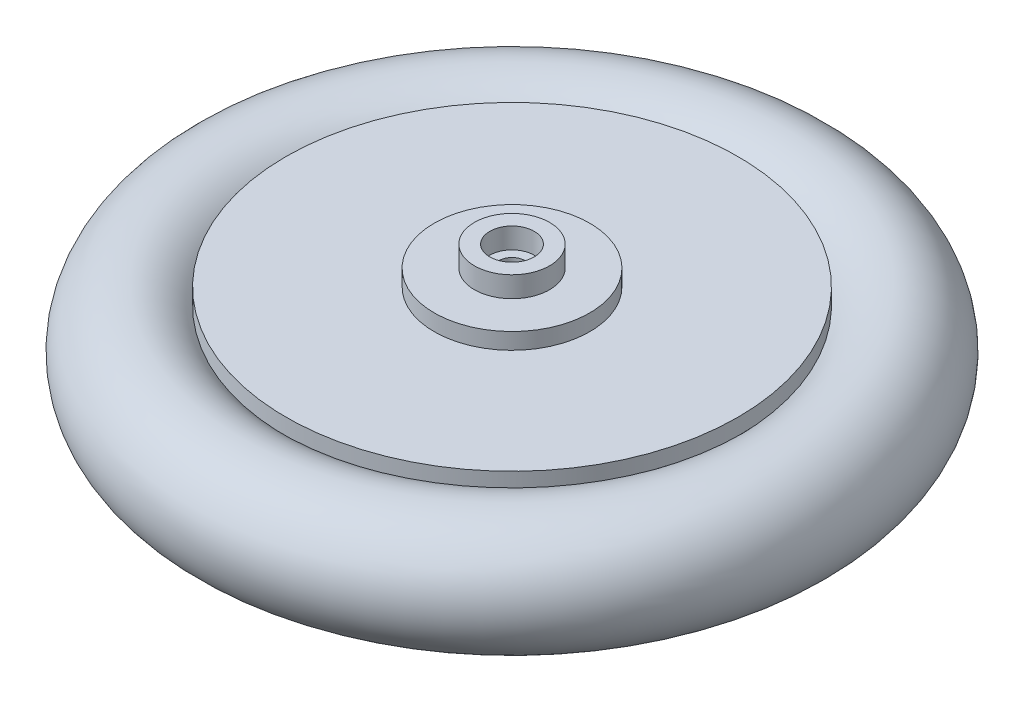
ISO-10303-21;
HEADER;
FILE_DESCRIPTION(('STEP AP214'),'2;1');
FILE_NAME('part.step','',(''),(''),'','','');
FILE_SCHEMA(('AUTOMOTIVE_DESIGN { 1 0 10303 214 1 1 1 1 }'));
ENDSEC;
DATA;
#1=APPLICATION_CONTEXT('core data for automotive mechanical design processes');
#2=APPLICATION_PROTOCOL_DEFINITION('international standard','automotive_design',2000,#1);
#3=PRODUCT_CONTEXT('',#1,'mechanical');
#4=PRODUCT('Part','Part','',(#3));
#5=PRODUCT_RELATED_PRODUCT_CATEGORY('part','',(#4));
#6=PRODUCT_DEFINITION_FORMATION('','',#4);
#7=PRODUCT_DEFINITION_CONTEXT('part definition',#1,'design');
#8=PRODUCT_DEFINITION('design','',#6,#7);
#9=PRODUCT_DEFINITION_SHAPE('','',#8);
#10=(LENGTH_UNIT() NAMED_UNIT(*) SI_UNIT(.MILLI.,.METRE.));
#11=(NAMED_UNIT(*) PLANE_ANGLE_UNIT() SI_UNIT($,.RADIAN.));
#12=(NAMED_UNIT(*) SI_UNIT($,.STERADIAN.) SOLID_ANGLE_UNIT());
#13=UNCERTAINTY_MEASURE_WITH_UNIT(LENGTH_MEASURE(1.E-05),#10,'distance_accuracy_value','');
#14=(GEOMETRIC_REPRESENTATION_CONTEXT(3) GLOBAL_UNCERTAINTY_ASSIGNED_CONTEXT((#13)) GLOBAL_UNIT_ASSIGNED_CONTEXT((#10,
#11,#12)) REPRESENTATION_CONTEXT('',''));
#15=CARTESIAN_POINT('',(0.,0.,0.));
#16=DIRECTION('',(0.,0.,1.));
#17=DIRECTION('',(1.,0.,0.));
#18=AXIS2_PLACEMENT_3D('',#15,#16,#17);
#19=CARTESIAN_POINT('',(-0.5,9.7,0.));
#20=DIRECTION('',(0.,1.,0.));
#21=DIRECTION('',(-1.,0.,0.));
#22=AXIS2_PLACEMENT_3D('',#19,#20,#21);
#23=CYLINDRICAL_SURFACE('',#22,30.5);
#24=CARTESIAN_POINT('',(-0.499999999999993,-5.2915026221292,0.));
#25=DIRECTION('',(0.,1.,0.));
#26=DIRECTION('',(-1.,0.,0.));
#27=AXIS2_PLACEMENT_3D('',#24,#25,#26);
#28=CIRCLE('',#27,30.5);
#29=CARTESIAN_POINT('',(-31.,-5.29150262212921,0.));
#30=VERTEX_POINT('',#29);
#31=EDGE_CURVE('E10',#30,#30,#28,.T.);
#32=ORIENTED_EDGE('',*,*,#31,.F.);
#33=EDGE_LOOP('',(#32));
#34=FACE_BOUND('',#33,.T.);
#35=CARTESIAN_POINT('',(-0.499999999999992,-7.50000000000001,0.));
#36=DIRECTION('',(0.,1.,0.));
#37=DIRECTION('',(-1.,0.,0.));
#38=AXIS2_PLACEMENT_3D('',#35,#36,#37);
#39=CIRCLE('',#38,30.5);
#40=CARTESIAN_POINT('',(-31.,-7.50000000000003,0.));
#41=VERTEX_POINT('',#40);
#42=EDGE_CURVE('E80',#41,#41,#39,.T.);
#43=ORIENTED_EDGE('',*,*,#42,.T.);
#44=EDGE_LOOP('',(#43));
#45=FACE_BOUND('',#44,.T.);
#46=ADVANCED_FACE('F34',(#34,#45),#23,.T.);
#47=CARTESIAN_POINT('',(-0.499999999999994,0.,0.));
#48=DIRECTION('',(0.,1.,0.));
#49=DIRECTION('',(-1.,0.,0.));
#50=AXIS2_PLACEMENT_3D('',#47,#48,#49);
#51=TOROIDAL_SURFACE('',#50,36.5,7.99999999999999);
#52=CARTESIAN_POINT('',(-0.499999999999998,5.29150262212917,0.));
#53=DIRECTION('',(0.,1.,0.));
#54=DIRECTION('',(-1.,0.,0.));
#55=AXIS2_PLACEMENT_3D('',#52,#53,#54);
#56=CIRCLE('',#55,30.5);
#57=CARTESIAN_POINT('',(-31.,5.29150262212915,0.));
#58=VERTEX_POINT('',#57);
#59=EDGE_CURVE('E40',#58,#58,#56,.T.);
#60=ORIENTED_EDGE('',*,*,#59,.F.);
#61=EDGE_LOOP('',(#60));
#62=FACE_BOUND('',#61,.T.);
#63=ORIENTED_EDGE('',*,*,#31,.T.);
#64=EDGE_LOOP('',(#63));
#65=FACE_BOUND('',#64,.T.);
#66=ADVANCED_FACE('F97',(#62,#65),#51,.T.);
#67=CARTESIAN_POINT('',(-0.5,9.7,0.));
#68=DIRECTION('',(0.,1.,0.));
#69=DIRECTION('',(-1.,0.,0.));
#70=AXIS2_PLACEMENT_3D('',#67,#68,#69);
#71=CYLINDRICAL_SURFACE('',#70,30.5);
#72=ORIENTED_EDGE('',*,*,#59,.T.);
#73=EDGE_LOOP('',(#72));
#74=FACE_BOUND('',#73,.T.);
#75=CARTESIAN_POINT('',(-0.499999999999999,7.49999999999998,0.));
#76=DIRECTION('',(0.,1.,0.));
#77=DIRECTION('',(-1.,0.,0.));
#78=AXIS2_PLACEMENT_3D('',#75,#76,#77);
#79=CIRCLE('',#78,30.5);
#80=CARTESIAN_POINT('',(-31.,7.49999999999997,0.));
#81=VERTEX_POINT('',#80);
#82=EDGE_CURVE('E44',#81,#81,#79,.T.);
#83=ORIENTED_EDGE('',*,*,#82,.F.);
#84=EDGE_LOOP('',(#83));
#85=FACE_BOUND('',#84,.T.);
#86=ADVANCED_FACE('F102',(#74,#85),#71,.T.);
#87=CARTESIAN_POINT('',(0.,7.49999999999999,0.));
#88=DIRECTION('',(0.,-1.,0.));
#89=DIRECTION('',(1.,0.,0.));
#90=AXIS2_PLACEMENT_3D('',#87,#88,#89);
#91=PLANE('',#90);
#92=CARTESIAN_POINT('',(-0.499999999999999,7.49999999999999,0.));
#93=DIRECTION('',(0.,1.,0.));
#94=DIRECTION('',(-1.,0.,0.));
#95=AXIS2_PLACEMENT_3D('',#92,#93,#94);
#96=CIRCLE('',#95,10.5);
#97=CARTESIAN_POINT('',(-11.,7.49999999999999,0.));
#98=VERTEX_POINT('',#97);
#99=EDGE_CURVE('E48',#98,#98,#96,.T.);
#100=ORIENTED_EDGE('',*,*,#99,.F.);
#101=EDGE_LOOP('',(#100));
#102=FACE_BOUND('',#101,.T.);
#103=ORIENTED_EDGE('',*,*,#82,.T.);
#104=EDGE_LOOP('',(#103));
#105=FACE_BOUND('',#104,.T.);
#106=ADVANCED_FACE('F107',(#102,#105),#91,.F.);
#107=CARTESIAN_POINT('',(-0.5,9.7,0.));
#108=DIRECTION('',(0.,1.,0.));
#109=DIRECTION('',(-1.,0.,0.));
#110=AXIS2_PLACEMENT_3D('',#107,#108,#109);
#111=CYLINDRICAL_SURFACE('',#110,10.5);
#112=ORIENTED_EDGE('',*,*,#99,.T.);
#113=EDGE_LOOP('',(#112));
#114=FACE_BOUND('',#113,.T.);
#115=CARTESIAN_POINT('',(-0.5,9.69999999999999,0.));
#116=DIRECTION('',(0.,1.,0.));
#117=DIRECTION('',(-1.,0.,0.));
#118=AXIS2_PLACEMENT_3D('',#115,#116,#117);
#119=CIRCLE('',#118,10.5);
#120=CARTESIAN_POINT('',(-11.,9.69999999999999,0.));
#121=VERTEX_POINT('',#120);
#122=EDGE_CURVE('E53',#121,#121,#119,.T.);
#123=ORIENTED_EDGE('',*,*,#122,.F.);
#124=EDGE_LOOP('',(#123));
#125=FACE_BOUND('',#124,.T.);
#126=ADVANCED_FACE('F112',(#114,#125),#111,.T.);
#127=CARTESIAN_POINT('',(0.,9.69999999999999,0.));
#128=DIRECTION('',(0.,1.,0.));
#129=DIRECTION('',(-1.,0.,0.));
#130=AXIS2_PLACEMENT_3D('',#127,#128,#129);
#131=PLANE('',#130);
#132=ORIENTED_EDGE('',*,*,#122,.T.);
#133=EDGE_LOOP('',(#132));
#134=FACE_BOUND('',#133,.T.);
#135=CARTESIAN_POINT('',(-0.5,9.7,0.));
#136=DIRECTION('',(0.,1.,0.));
#137=DIRECTION('',(-1.,0.,0.));
#138=AXIS2_PLACEMENT_3D('',#135,#136,#137);
#139=CIRCLE('',#138,5.07841912747767);
#140=CARTESIAN_POINT('',(-5.57841912747767,9.69999999999999,0.));
#141=VERTEX_POINT('',#140);
#142=EDGE_CURVE('E56',#141,#141,#139,.T.);
#143=ORIENTED_EDGE('',*,*,#142,.F.);
#144=EDGE_LOOP('',(#143));
#145=FACE_BOUND('',#144,.T.);
#146=ADVANCED_FACE('F116',(#134,#145),#131,.T.);
#147=CARTESIAN_POINT('',(-0.5,9.7,0.));
#148=DIRECTION('',(0.,1.,0.));
#149=DIRECTION('',(-1.,0.,0.));
#150=AXIS2_PLACEMENT_3D('',#147,#148,#149);
#151=CYLINDRICAL_SURFACE('',#150,5.07841912747767);
#152=ORIENTED_EDGE('',*,*,#142,.T.);
#153=EDGE_LOOP('',(#152));
#154=FACE_BOUND('',#153,.T.);
#155=CARTESIAN_POINT('',(-0.500000000000001,12.5,0.));
#156=DIRECTION('',(0.,1.,0.));
#157=DIRECTION('',(-1.,0.,0.));
#158=AXIS2_PLACEMENT_3D('',#155,#156,#157);
#159=CIRCLE('',#158,5.07841912747767);
#160=CARTESIAN_POINT('',(-5.57841912747767,12.5,0.));
#161=VERTEX_POINT('',#160);
#162=EDGE_CURVE('E59',#161,#161,#159,.T.);
#163=ORIENTED_EDGE('',*,*,#162,.F.);
#164=EDGE_LOOP('',(#163));
#165=FACE_BOUND('',#164,.T.);
#166=ADVANCED_FACE('F120',(#154,#165),#151,.T.);
#167=CARTESIAN_POINT('',(0.,12.5,0.));
#168=DIRECTION('',(0.,1.,0.));
#169=DIRECTION('',(-1.,0.,0.));
#170=AXIS2_PLACEMENT_3D('',#167,#168,#169);
#171=PLANE('',#170);
#172=ORIENTED_EDGE('',*,*,#162,.T.);
#173=EDGE_LOOP('',(#172));
#174=FACE_BOUND('',#173,.T.);
#175=CARTESIAN_POINT('',(-0.500000000000001,12.5,0.));
#176=DIRECTION('',(0.,1.,0.));
#177=DIRECTION('',(-1.,0.,0.));
#178=AXIS2_PLACEMENT_3D('',#175,#176,#177);
#179=CIRCLE('',#178,3.);
#180=CARTESIAN_POINT('',(-3.5,12.5,0.));
#181=VERTEX_POINT('',#180);
#182=EDGE_CURVE('E62',#181,#181,#179,.T.);
#183=ORIENTED_EDGE('',*,*,#182,.F.);
#184=EDGE_LOOP('',(#183));
#185=FACE_BOUND('',#184,.T.);
#186=ADVANCED_FACE('F124',(#174,#185),#171,.T.);
#187=CARTESIAN_POINT('',(-0.5,9.7,0.));
#188=DIRECTION('',(0.,1.,0.));
#189=DIRECTION('',(-1.,0.,0.));
#190=AXIS2_PLACEMENT_3D('',#187,#188,#189);
#191=CYLINDRICAL_SURFACE('',#190,3.);
#192=ORIENTED_EDGE('',*,*,#182,.T.);
#193=EDGE_LOOP('',(#192));
#194=FACE_BOUND('',#193,.T.);
#195=CARTESIAN_POINT('',(-0.5,9.7,0.));
#196=DIRECTION('',(0.,1.,0.));
#197=DIRECTION('',(-1.,0.,0.));
#198=AXIS2_PLACEMENT_3D('',#195,#196,#197);
#199=CIRCLE('',#198,3.);
#200=CARTESIAN_POINT('',(-3.5,9.69999999999999,0.));
#201=VERTEX_POINT('',#200);
#202=EDGE_CURVE('E65',#201,#201,#199,.T.);
#203=ORIENTED_EDGE('',*,*,#202,.F.);
#204=EDGE_LOOP('',(#203));
#205=FACE_BOUND('',#204,.T.);
#206=ADVANCED_FACE('F128',(#194,#205),#191,.F.);
#207=CARTESIAN_POINT('',(0.,9.7,0.));
#208=DIRECTION('',(0.,1.,0.));
#209=DIRECTION('',(-1.,0.,0.));
#210=AXIS2_PLACEMENT_3D('',#207,#208,#209);
#211=PLANE('',#210);
#212=ORIENTED_EDGE('',*,*,#202,.T.);
#213=EDGE_LOOP('',(#212));
#214=FACE_BOUND('',#213,.T.);
#215=CARTESIAN_POINT('',(-0.5,9.7,0.));
#216=DIRECTION('',(0.,1.,0.));
#217=DIRECTION('',(-1.,0.,0.));
#218=AXIS2_PLACEMENT_3D('',#215,#216,#217);
#219=CIRCLE('',#218,1.75);
#220=CARTESIAN_POINT('',(-2.25,9.7,0.));
#221=VERTEX_POINT('',#220);
#222=EDGE_CURVE('E68',#221,#221,#219,.T.);
#223=ORIENTED_EDGE('',*,*,#222,.F.);
#224=EDGE_LOOP('',(#223));
#225=FACE_BOUND('',#224,.T.);
#226=ADVANCED_FACE('F132',(#214,#225),#211,.T.);
#227=CARTESIAN_POINT('',(-0.5,9.7,0.));
#228=DIRECTION('',(0.,1.,0.));
#229=DIRECTION('',(-1.,0.,0.));
#230=AXIS2_PLACEMENT_3D('',#227,#228,#229);
#231=CYLINDRICAL_SURFACE('',#230,1.75);
#232=ORIENTED_EDGE('',*,*,#222,.T.);
#233=EDGE_LOOP('',(#232));
#234=FACE_BOUND('',#233,.T.);
#235=CARTESIAN_POINT('',(-0.499999999999999,7.5,0.));
#236=DIRECTION('',(0.,1.,0.));
#237=DIRECTION('',(-1.,0.,0.));
#238=AXIS2_PLACEMENT_3D('',#235,#236,#237);
#239=CIRCLE('',#238,1.75);
#240=CARTESIAN_POINT('',(-2.25,7.49999999999999,0.));
#241=VERTEX_POINT('',#240);
#242=EDGE_CURVE('E71',#241,#241,#239,.T.);
#243=ORIENTED_EDGE('',*,*,#242,.F.);
#244=EDGE_LOOP('',(#243));
#245=FACE_BOUND('',#244,.T.);
#246=ADVANCED_FACE('F136',(#234,#245),#231,.F.);
#247=CARTESIAN_POINT('',(0.,7.5,0.));
#248=DIRECTION('',(0.,-1.,0.));
#249=DIRECTION('',(1.,0.,0.));
#250=AXIS2_PLACEMENT_3D('',#247,#248,#249);
#251=PLANE('',#250);
#252=ORIENTED_EDGE('',*,*,#242,.T.);
#253=EDGE_LOOP('',(#252));
#254=FACE_BOUND('',#253,.T.);
#255=CARTESIAN_POINT('',(-0.499999999999999,7.49999999999999,0.));
#256=DIRECTION('',(0.,1.,0.));
#257=DIRECTION('',(-1.,0.,0.));
#258=AXIS2_PLACEMENT_3D('',#255,#256,#257);
#259=CIRCLE('',#258,3.4333427365259);
#260=CARTESIAN_POINT('',(-3.9333427365259,7.49999999999999,0.));
#261=VERTEX_POINT('',#260);
#262=EDGE_CURVE('E74',#261,#261,#259,.T.);
#263=ORIENTED_EDGE('',*,*,#262,.F.);
#264=EDGE_LOOP('',(#263));
#265=FACE_BOUND('',#264,.T.);
#266=ADVANCED_FACE('F93',(#254,#265),#251,.T.);
#267=CARTESIAN_POINT('',(-0.5,9.7,0.));
#268=DIRECTION('',(0.,1.,0.));
#269=DIRECTION('',(-1.,0.,0.));
#270=AXIS2_PLACEMENT_3D('',#267,#268,#269);
#271=CYLINDRICAL_SURFACE('',#270,3.4333427365259);
#272=ORIENTED_EDGE('',*,*,#262,.T.);
#273=EDGE_LOOP('',(#272));
#274=FACE_BOUND('',#273,.T.);
#275=CARTESIAN_POINT('',(-0.499999999999992,-7.5,0.));
#276=DIRECTION('',(0.,1.,0.));
#277=DIRECTION('',(-1.,0.,0.));
#278=AXIS2_PLACEMENT_3D('',#275,#276,#277);
#279=CIRCLE('',#278,3.43334273652589);
#280=CARTESIAN_POINT('',(-3.93334273652588,-7.5,0.));
#281=VERTEX_POINT('',#280);
#282=EDGE_CURVE('E77',#281,#281,#279,.T.);
#283=ORIENTED_EDGE('',*,*,#282,.F.);
#284=EDGE_LOOP('',(#283));
#285=FACE_BOUND('',#284,.T.);
#286=ADVANCED_FACE('F87',(#274,#285),#271,.F.);
#287=CARTESIAN_POINT('',(0.,-7.50000000000001,0.));
#288=DIRECTION('',(0.,-1.,0.));
#289=DIRECTION('',(1.,0.,0.));
#290=AXIS2_PLACEMENT_3D('',#287,#288,#289);
#291=PLANE('',#290);
#292=ORIENTED_EDGE('',*,*,#282,.T.);
#293=EDGE_LOOP('',(#292));
#294=FACE_BOUND('',#293,.T.);
#295=ORIENTED_EDGE('',*,*,#42,.F.);
#296=EDGE_LOOP('',(#295));
#297=FACE_BOUND('',#296,.T.);
#298=ADVANCED_FACE('F85',(#294,#297),#291,.T.);
#299=CLOSED_SHELL('',(#46,#66,#86,#106,#126,#146,#166,#186,#206,#226,#246,#266,#286,#298));
#300=MANIFOLD_SOLID_BREP('B2',#299);
#301=ADVANCED_BREP_SHAPE_REPRESENTATION('',(#18,#300),#14);
#302=SHAPE_DEFINITION_REPRESENTATION(#9,#301);
ENDSEC;
END-ISO-10303-21;
